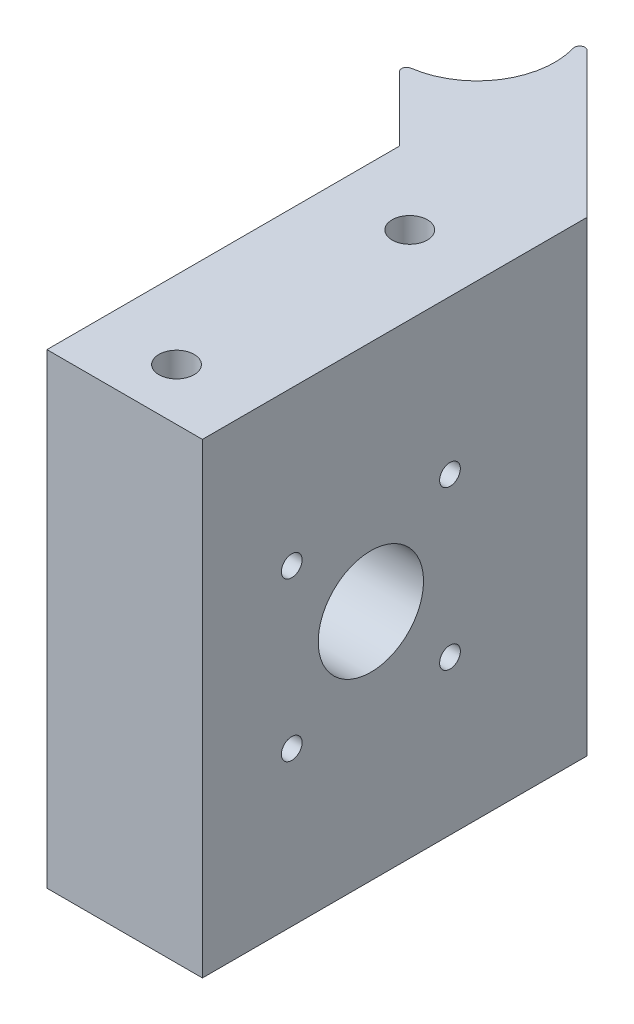
ISO-10303-21;
HEADER;
FILE_DESCRIPTION(('STEP AP214'),'2;1');
FILE_NAME('part.step','',(''),(''),'','','');
FILE_SCHEMA(('AUTOMOTIVE_DESIGN { 1 0 10303 214 1 1 1 1 }'));
ENDSEC;
DATA;
#1=APPLICATION_CONTEXT('core data for automotive mechanical design processes');
#2=APPLICATION_PROTOCOL_DEFINITION('international standard','automotive_design',2000,#1);
#3=PRODUCT_CONTEXT('',#1,'mechanical');
#4=PRODUCT('Part','Part','',(#3));
#5=PRODUCT_RELATED_PRODUCT_CATEGORY('part','',(#4));
#6=PRODUCT_DEFINITION_FORMATION('','',#4);
#7=PRODUCT_DEFINITION_CONTEXT('part definition',#1,'design');
#8=PRODUCT_DEFINITION('design','',#6,#7);
#9=PRODUCT_DEFINITION_SHAPE('','',#8);
#10=(LENGTH_UNIT() NAMED_UNIT(*) SI_UNIT(.MILLI.,.METRE.));
#11=(NAMED_UNIT(*) PLANE_ANGLE_UNIT() SI_UNIT($,.RADIAN.));
#12=(NAMED_UNIT(*) SI_UNIT($,.STERADIAN.) SOLID_ANGLE_UNIT());
#13=UNCERTAINTY_MEASURE_WITH_UNIT(LENGTH_MEASURE(1.E-05),#10,'distance_accuracy_value','');
#14=(GEOMETRIC_REPRESENTATION_CONTEXT(3) GLOBAL_UNCERTAINTY_ASSIGNED_CONTEXT((#13)) GLOBAL_UNIT_ASSIGNED_CONTEXT((#10,
#11,#12)) REPRESENTATION_CONTEXT('',''));
#15=CARTESIAN_POINT('',(0.,0.,0.));
#16=DIRECTION('',(0.,0.,1.));
#17=DIRECTION('',(1.,0.,0.));
#18=AXIS2_PLACEMENT_3D('',#15,#16,#17);
#19=CARTESIAN_POINT('',(10.7499999999999,45.,-10.7499999999998));
#20=DIRECTION('',(0.707106781186551,0.,-0.707106781186544));
#21=DIRECTION('',(-0.707106781186544,0.,-0.707106781186551));
#22=AXIS2_PLACEMENT_3D('',#19,#20,#21);
#23=PLANE('',#22);
#24=DIRECTION('',(0.707106781186541,0.,0.707106781186554));
#25=VECTOR('',#24,1.);
#26=CARTESIAN_POINT('',(-13.1082590496992,37.5,-34.6082590496992));
#27=LINE('',#26,#25);
#28=CARTESIAN_POINT('',(-13.1082590496992,37.5,-34.6082590496992));
#29=VERTEX_POINT('',#28);
#30=CARTESIAN_POINT('',(-11.8419971910119,37.5,-33.3419971910118));
#31=VERTEX_POINT('',#30);
#32=EDGE_CURVE('E278',#29,#31,#27,.T.);
#33=ORIENTED_EDGE('',*,*,#32,.F.);
#34=DIRECTION('',(0.,1.,0.));
#35=VECTOR('',#34,1.);
#36=CARTESIAN_POINT('',(-13.1082590496992,37.5,-34.6082590496992));
#37=LINE('',#36,#35);
#38=CARTESIAN_POINT('',(-13.1082590496992,41.5,-34.6082590496992));
#39=VERTEX_POINT('',#38);
#40=EDGE_CURVE('E293',#29,#39,#37,.T.);
#41=ORIENTED_EDGE('',*,*,#40,.T.);
#42=DIRECTION('',(0.707106781186541,0.,0.707106781186554));
#43=VECTOR('',#42,1.);
#44=CARTESIAN_POINT('',(-13.1082590496992,41.5,-34.6082590496992));
#45=LINE('',#44,#43);
#46=CARTESIAN_POINT('',(-11.8419971910119,41.5,-33.3419971910118));
#47=VERTEX_POINT('',#46);
#48=EDGE_CURVE('E296',#39,#47,#45,.T.);
#49=ORIENTED_EDGE('',*,*,#48,.T.);
#50=DIRECTION('',(0.,1.,0.));
#51=VECTOR('',#50,1.);
#52=CARTESIAN_POINT('',(-11.8419971910119,37.5,-33.3419971910118));
#53=LINE('',#52,#51);
#54=EDGE_CURVE('E321',#31,#47,#53,.T.);
#55=ORIENTED_EDGE('',*,*,#54,.F.);
#56=EDGE_LOOP('',(#33,#41,#49,#55));
#57=FACE_BOUND('',#56,.T.);
#58=DIRECTION('',(0.707106781186544,0.,0.707106781186551));
#59=VECTOR('',#58,1.);
#60=CARTESIAN_POINT('',(10.7499999999999,45.,-10.7499999999998));
#61=LINE('',#60,#59);
#62=CARTESIAN_POINT('',(-13.7262680860323,45.,-35.2262680860323));
#63=VERTEX_POINT('',#62);
#64=CARTESIAN_POINT('',(-7.5,45.,-28.9999999999999));
#65=VERTEX_POINT('',#64);
#66=EDGE_CURVE('E410',#63,#65,#61,.T.);
#67=ORIENTED_EDGE('',*,*,#66,.F.);
#68=DIRECTION('',(0.,1.,0.));
#69=VECTOR('',#68,1.);
#70=CARTESIAN_POINT('',(-13.7262680860323,0.,-35.2262680860323));
#71=LINE('',#70,#69);
#72=CARTESIAN_POINT('',(-13.7262680860323,0.,-35.2262680860323));
#73=VERTEX_POINT('',#72);
#74=EDGE_CURVE('E13',#63,#73,#71,.F.);
#75=ORIENTED_EDGE('',*,*,#74,.T.);
#76=DIRECTION('',(0.707106781186544,0.,0.707106781186551));
#77=VECTOR('',#76,1.);
#78=CARTESIAN_POINT('',(10.7499999999999,0.,-10.7499999999998));
#79=LINE('',#78,#77);
#80=CARTESIAN_POINT('',(-7.5,0.,-28.9999999999999));
#81=VERTEX_POINT('',#80);
#82=EDGE_CURVE('E433',#73,#81,#79,.T.);
#83=ORIENTED_EDGE('',*,*,#82,.T.);
#84=DIRECTION('',(0.,-1.,0.));
#85=VECTOR('',#84,1.);
#86=CARTESIAN_POINT('',(-7.5,45.,-28.9999999999999));
#87=LINE('',#86,#85);
#88=EDGE_CURVE('E457',#65,#81,#87,.T.);
#89=ORIENTED_EDGE('',*,*,#88,.F.);
#90=EDGE_LOOP('',(#67,#75,#83,#89));
#91=FACE_BOUND('',#90,.T.);
#92=DIRECTION('',(0.707106781186541,0.,0.707106781186554));
#93=VECTOR('',#92,1.);
#94=CARTESIAN_POINT('',(-13.1082590496992,20.5,-34.6082590496992));
#95=LINE('',#94,#93);
#96=CARTESIAN_POINT('',(-13.1082590496992,20.5,-34.6082590496992));
#97=VERTEX_POINT('',#96);
#98=CARTESIAN_POINT('',(-11.8419971910119,20.5,-33.3419971910118));
#99=VERTEX_POINT('',#98);
#100=EDGE_CURVE('E329',#97,#99,#95,.T.);
#101=ORIENTED_EDGE('',*,*,#100,.F.);
#102=DIRECTION('',(0.,1.,0.));
#103=VECTOR('',#102,1.);
#104=CARTESIAN_POINT('',(-13.1082590496992,20.5,-34.6082590496992));
#105=LINE('',#104,#103);
#106=CARTESIAN_POINT('',(-13.1082590496992,24.5,-34.6082590496992));
#107=VERTEX_POINT('',#106);
#108=EDGE_CURVE('E344',#97,#107,#105,.T.);
#109=ORIENTED_EDGE('',*,*,#108,.T.);
#110=DIRECTION('',(0.707106781186541,0.,0.707106781186554));
#111=VECTOR('',#110,1.);
#112=CARTESIAN_POINT('',(-13.1082590496992,24.5,-34.6082590496992));
#113=LINE('',#112,#111);
#114=CARTESIAN_POINT('',(-11.8419971910119,24.5,-33.3419971910118));
#115=VERTEX_POINT('',#114);
#116=EDGE_CURVE('E347',#107,#115,#113,.T.);
#117=ORIENTED_EDGE('',*,*,#116,.T.);
#118=DIRECTION('',(0.,1.,0.));
#119=VECTOR('',#118,1.);
#120=CARTESIAN_POINT('',(-11.8419971910119,20.5,-33.3419971910118));
#121=LINE('',#120,#119);
#122=EDGE_CURVE('E372',#99,#115,#121,.T.);
#123=ORIENTED_EDGE('',*,*,#122,.F.);
#124=EDGE_LOOP('',(#101,#109,#117,#123));
#125=FACE_BOUND('',#124,.T.);
#126=DIRECTION('',(0.707106781186541,0.,0.707106781186554));
#127=VECTOR('',#126,1.);
#128=CARTESIAN_POINT('',(-13.1082590496992,7.5,-34.6082590496992));
#129=LINE('',#128,#127);
#130=CARTESIAN_POINT('',(-13.1082590496992,7.5,-34.6082590496992));
#131=VERTEX_POINT('',#130);
#132=CARTESIAN_POINT('',(-11.8419971910119,7.5,-33.3419971910118));
#133=VERTEX_POINT('',#132);
#134=EDGE_CURVE('E240',#131,#133,#129,.T.);
#135=ORIENTED_EDGE('',*,*,#134,.T.);
#136=DIRECTION('',(0.,-1.,0.));
#137=VECTOR('',#136,1.);
#138=CARTESIAN_POINT('',(-11.8419971910119,7.5,-33.3419971910118));
#139=LINE('',#138,#137);
#140=CARTESIAN_POINT('',(-11.8419971910119,3.5,-33.3419971910118));
#141=VERTEX_POINT('',#140);
#142=EDGE_CURVE('E267',#133,#141,#139,.T.);
#143=ORIENTED_EDGE('',*,*,#142,.T.);
#144=DIRECTION('',(0.707106781186541,0.,0.707106781186554));
#145=VECTOR('',#144,1.);
#146=CARTESIAN_POINT('',(-13.1082590496992,3.5,-34.6082590496992));
#147=LINE('',#146,#145);
#148=CARTESIAN_POINT('',(-13.1082590496992,3.5,-34.6082590496992));
#149=VERTEX_POINT('',#148);
#150=EDGE_CURVE('E245',#149,#141,#147,.T.);
#151=ORIENTED_EDGE('',*,*,#150,.F.);
#152=DIRECTION('',(0.,-1.,0.));
#153=VECTOR('',#152,1.);
#154=CARTESIAN_POINT('',(-13.1082590496992,7.5,-34.6082590496992));
#155=LINE('',#154,#153);
#156=EDGE_CURVE('E264',#131,#149,#155,.T.);
#157=ORIENTED_EDGE('',*,*,#156,.F.);
#158=EDGE_LOOP('',(#135,#143,#151,#157));
#159=FACE_BOUND('',#158,.T.);
#160=ADVANCED_FACE('F48',(#57,#91,#125,#159),#23,.F.);
#161=CARTESIAN_POINT('',(19.8033008588991,45.,-19.8033008588988));
#162=DIRECTION('',(0.707106781186551,0.,-0.707106781186544));
#163=DIRECTION('',(-0.707106781186544,0.,-0.707106781186551));
#164=AXIS2_PLACEMENT_3D('',#161,#162,#163);
#165=PLANE('',#164);
#166=DIRECTION('',(0.707106781186544,0.,0.707106781186551));
#167=VECTOR('',#166,1.);
#168=CARTESIAN_POINT('',(19.8033008588991,0.,-19.8033008588988));
#169=LINE('',#168,#167);
#170=CARTESIAN_POINT('',(-6.45808635357504,0.,-46.0646880713732));
#171=VERTEX_POINT('',#170);
#172=CARTESIAN_POINT('',(7.49999999999999,0.,-32.106601717798));
#173=VERTEX_POINT('',#172);
#174=EDGE_CURVE('E444',#171,#173,#169,.T.);
#175=ORIENTED_EDGE('',*,*,#174,.F.);
#176=DIRECTION('',(0.,-1.,0.));
#177=VECTOR('',#176,1.);
#178=CARTESIAN_POINT('',(-6.45808635357505,45.,-46.0646880713732));
#179=LINE('',#178,#177);
#180=CARTESIAN_POINT('',(-6.45808635357504,45.,-46.0646880713732));
#181=VERTEX_POINT('',#180);
#182=EDGE_CURVE('E469',#171,#181,#179,.F.);
#183=ORIENTED_EDGE('',*,*,#182,.T.);
#184=DIRECTION('',(0.707106781186544,0.,0.707106781186551));
#185=VECTOR('',#184,1.);
#186=CARTESIAN_POINT('',(19.8033008588991,45.,-19.8033008588988));
#187=LINE('',#186,#185);
#188=CARTESIAN_POINT('',(7.49999999999999,45.,-32.106601717798));
#189=VERTEX_POINT('',#188);
#190=EDGE_CURVE('E422',#181,#189,#187,.T.);
#191=ORIENTED_EDGE('',*,*,#190,.T.);
#192=DIRECTION('',(0.,-1.,0.));
#193=VECTOR('',#192,1.);
#194=CARTESIAN_POINT('',(7.49999999999999,45.,-32.106601717798));
#195=LINE('',#194,#193);
#196=EDGE_CURVE('E430',#189,#173,#195,.T.);
#197=ORIENTED_EDGE('',*,*,#196,.T.);
#198=EDGE_LOOP('',(#175,#183,#191,#197));
#199=FACE_BOUND('',#198,.T.);
#200=DIRECTION('',(0.,1.,0.));
#201=VECTOR('',#200,1.);
#202=CARTESIAN_POINT('',(-2.83273811042198,20.5,-42.4393398282201));
#203=LINE('',#202,#201);
#204=CARTESIAN_POINT('',(-2.83273811042198,20.5,-42.4393398282201));
#205=VERTEX_POINT('',#204);
#206=CARTESIAN_POINT('',(-2.83273811042198,24.5,-42.4393398282201));
#207=VERTEX_POINT('',#206);
#208=EDGE_CURVE('E364',#205,#207,#203,.T.);
#209=ORIENTED_EDGE('',*,*,#208,.F.);
#210=DIRECTION('',(-0.707106781186544,0.,-0.707106781186551));
#211=VECTOR('',#210,1.);
#212=CARTESIAN_POINT('',(-2.83273811042198,20.5,-42.4393398282201));
#213=LINE('',#212,#211);
#214=CARTESIAN_POINT('',(-1.77207793864216,20.5,-41.3786796564403));
#215=VERTEX_POINT('',#214);
#216=EDGE_CURVE('E339',#215,#205,#213,.T.);
#217=ORIENTED_EDGE('',*,*,#216,.F.);
#218=DIRECTION('',(0.,1.,0.));
#219=VECTOR('',#218,1.);
#220=CARTESIAN_POINT('',(-1.77207793864216,20.5,-41.3786796564403));
#221=LINE('',#220,#219);
#222=CARTESIAN_POINT('',(-1.77207793864216,24.5,-41.3786796564403));
#223=VERTEX_POINT('',#222);
#224=EDGE_CURVE('E367',#215,#223,#221,.T.);
#225=ORIENTED_EDGE('',*,*,#224,.T.);
#226=DIRECTION('',(-0.707106781186544,0.,-0.707106781186551));
#227=VECTOR('',#226,1.);
#228=CARTESIAN_POINT('',(-2.83273811042198,24.5,-42.4393398282201));
#229=LINE('',#228,#227);
#230=EDGE_CURVE('E356',#223,#207,#229,.T.);
#231=ORIENTED_EDGE('',*,*,#230,.T.);
#232=EDGE_LOOP('',(#209,#217,#225,#231));
#233=FACE_BOUND('',#232,.T.);
#234=DIRECTION('',(0.,1.,0.));
#235=VECTOR('',#234,1.);
#236=CARTESIAN_POINT('',(-2.83273811042198,37.5,-42.4393398282201));
#237=LINE('',#236,#235);
#238=CARTESIAN_POINT('',(-2.83273811042198,37.5,-42.4393398282201));
#239=VERTEX_POINT('',#238);
#240=CARTESIAN_POINT('',(-2.83273811042198,41.5,-42.4393398282201));
#241=VERTEX_POINT('',#240);
#242=EDGE_CURVE('E313',#239,#241,#237,.T.);
#243=ORIENTED_EDGE('',*,*,#242,.F.);
#244=DIRECTION('',(-0.707106781186544,0.,-0.707106781186551));
#245=VECTOR('',#244,1.);
#246=CARTESIAN_POINT('',(-2.83273811042198,37.5,-42.4393398282201));
#247=LINE('',#246,#245);
#248=CARTESIAN_POINT('',(-1.77207793864216,37.5,-41.3786796564403));
#249=VERTEX_POINT('',#248);
#250=EDGE_CURVE('E288',#249,#239,#247,.T.);
#251=ORIENTED_EDGE('',*,*,#250,.F.);
#252=DIRECTION('',(0.,1.,0.));
#253=VECTOR('',#252,1.);
#254=CARTESIAN_POINT('',(-1.77207793864216,37.5,-41.3786796564403));
#255=LINE('',#254,#253);
#256=CARTESIAN_POINT('',(-1.77207793864216,41.5,-41.3786796564403));
#257=VERTEX_POINT('',#256);
#258=EDGE_CURVE('E316',#249,#257,#255,.T.);
#259=ORIENTED_EDGE('',*,*,#258,.T.);
#260=DIRECTION('',(-0.707106781186544,0.,-0.707106781186551));
#261=VECTOR('',#260,1.);
#262=CARTESIAN_POINT('',(-2.83273811042198,41.5,-42.4393398282201));
#263=LINE('',#262,#261);
#264=EDGE_CURVE('E305',#257,#241,#263,.T.);
#265=ORIENTED_EDGE('',*,*,#264,.T.);
#266=EDGE_LOOP('',(#243,#251,#259,#265));
#267=FACE_BOUND('',#266,.T.);
#268=DIRECTION('',(0.,-1.,0.));
#269=VECTOR('',#268,1.);
#270=CARTESIAN_POINT('',(-1.77207793864216,7.5,-41.3786796564403));
#271=LINE('',#270,#269);
#272=CARTESIAN_POINT('',(-1.77207793864216,7.5,-41.3786796564403));
#273=VERTEX_POINT('',#272);
#274=CARTESIAN_POINT('',(-1.77207793864216,3.5,-41.3786796564403));
#275=VERTEX_POINT('',#274);
#276=EDGE_CURVE('E71',#273,#275,#271,.T.);
#277=ORIENTED_EDGE('',*,*,#276,.F.);
#278=DIRECTION('',(-0.707106781186544,0.,-0.707106781186551));
#279=VECTOR('',#278,1.);
#280=CARTESIAN_POINT('',(-2.83273811042198,7.5,-42.4393398282201));
#281=LINE('',#280,#279);
#282=CARTESIAN_POINT('',(-2.83273811042198,7.5,-42.4393398282201));
#283=VERTEX_POINT('',#282);
#284=EDGE_CURVE('E233',#273,#283,#281,.T.);
#285=ORIENTED_EDGE('',*,*,#284,.T.);
#286=DIRECTION('',(0.,-1.,0.));
#287=VECTOR('',#286,1.);
#288=CARTESIAN_POINT('',(-2.83273811042198,7.5,-42.4393398282201));
#289=LINE('',#288,#287);
#290=CARTESIAN_POINT('',(-2.83273811042198,3.5,-42.4393398282201));
#291=VERTEX_POINT('',#290);
#292=EDGE_CURVE('E228',#283,#291,#289,.T.);
#293=ORIENTED_EDGE('',*,*,#292,.T.);
#294=DIRECTION('',(-0.707106781186544,0.,-0.707106781186551));
#295=VECTOR('',#294,1.);
#296=CARTESIAN_POINT('',(-2.83273811042198,3.5,-42.4393398282201));
#297=LINE('',#296,#295);
#298=EDGE_CURVE('E259',#275,#291,#297,.T.);
#299=ORIENTED_EDGE('',*,*,#298,.F.);
#300=EDGE_LOOP('',(#277,#285,#293,#299));
#301=FACE_BOUND('',#300,.T.);
#302=ADVANCED_FACE('F493',(#199,#233,#267,#301),#165,.T.);
#303=CARTESIAN_POINT('',(-14.5,45.,-43.5));
#304=DIRECTION('',(0.,-1.,0.));
#305=DIRECTION('',(0.,0.,-1.));
#306=AXIS2_PLACEMENT_3D('',#303,#304,#305);
#307=CYLINDRICAL_SURFACE('',#306,7.5);
#308=CARTESIAN_POINT('',(-14.5,45.,-43.5));
#309=DIRECTION('',(0.,1.,0.));
#310=DIRECTION('',(0.,0.,1.));
#311=AXIS2_PLACEMENT_3D('',#308,#309,#310);
#312=CIRCLE('',#311,7.5);
#313=CARTESIAN_POINT('',(-13.4431700269741,45.,-36.0748326343365));
#314=VERTEX_POINT('',#313);
#315=CARTESIAN_POINT('',(-7.2921622601578,45.,-45.5729387632312));
#316=VERTEX_POINT('',#315);
#317=EDGE_CURVE('E407',#314,#316,#312,.T.);
#318=ORIENTED_EDGE('',*,*,#317,.T.);
#319=DIRECTION('',(0.,-1.,0.));
#320=VECTOR('',#319,1.);
#321=CARTESIAN_POINT('',(-7.2921622601578,45.,-45.5729387632312));
#322=LINE('',#321,#320);
#323=CARTESIAN_POINT('',(-7.2921622601578,0.,-45.5729387632312));
#324=VERTEX_POINT('',#323);
#325=EDGE_CURVE('E462',#316,#324,#322,.T.);
#326=ORIENTED_EDGE('',*,*,#325,.T.);
#327=CARTESIAN_POINT('',(-14.5,0.,-43.5));
#328=DIRECTION('',(0.,1.,0.));
#329=DIRECTION('',(0.,0.,1.));
#330=AXIS2_PLACEMENT_3D('',#327,#328,#329);
#331=CIRCLE('',#330,7.5);
#332=CARTESIAN_POINT('',(-13.4431700269741,0.,-36.0748326343365));
#333=VERTEX_POINT('',#332);
#334=EDGE_CURVE('E404',#333,#324,#331,.T.);
#335=ORIENTED_EDGE('',*,*,#334,.F.);
#336=DIRECTION('',(0.,-1.,0.));
#337=VECTOR('',#336,1.);
#338=CARTESIAN_POINT('',(-13.4431700269741,45.,-36.0748326343365));
#339=LINE('',#338,#337);
#340=EDGE_CURVE('E460',#333,#314,#339,.F.);
#341=ORIENTED_EDGE('',*,*,#340,.T.);
#342=EDGE_LOOP('',(#318,#326,#335,#341));
#343=FACE_BOUND('',#342,.T.);
#344=ADVANCED_FACE('F484',(#343),#307,.F.);
#345=CARTESIAN_POINT('',(-7.5,45.,0.));
#346=DIRECTION('',(-1.,0.,0.));
#347=DIRECTION('',(0.,0.,1.));
#348=AXIS2_PLACEMENT_3D('',#345,#346,#347);
#349=PLANE('',#348);
#350=CARTESIAN_POINT('',(-7.5,14.867,-3.617));
#351=DIRECTION('',(-1.,0.,0.));
#352=DIRECTION('',(0.,0.,1.));
#353=AXIS2_PLACEMENT_3D('',#350,#351,#352);
#354=CIRCLE('',#353,1.);
#355=CARTESIAN_POINT('',(-7.5,14.867,-2.617));
#356=VERTEX_POINT('',#355);
#357=EDGE_CURVE('E363',#356,#356,#354,.F.);
#358=ORIENTED_EDGE('',*,*,#357,.T.);
#359=EDGE_LOOP('',(#358));
#360=FACE_BOUND('',#359,.T.);
#361=CARTESIAN_POINT('',(-7.5,14.867,-18.883));
#362=DIRECTION('',(-1.,0.,0.));
#363=DIRECTION('',(0.,0.,1.));
#364=AXIS2_PLACEMENT_3D('',#361,#362,#363);
#365=CIRCLE('',#364,1.);
#366=CARTESIAN_POINT('',(-7.5,14.867,-17.883));
#367=VERTEX_POINT('',#366);
#368=EDGE_CURVE('E380',#367,#367,#365,.F.);
#369=ORIENTED_EDGE('',*,*,#368,.T.);
#370=EDGE_LOOP('',(#369));
#371=FACE_BOUND('',#370,.T.);
#372=CARTESIAN_POINT('',(-7.5,30.133,-18.883));
#373=DIRECTION('',(-1.,0.,0.));
#374=DIRECTION('',(0.,0.,1.));
#375=AXIS2_PLACEMENT_3D('',#372,#373,#374);
#376=CIRCLE('',#375,1.);
#377=CARTESIAN_POINT('',(-7.5,30.133,-17.883));
#378=VERTEX_POINT('',#377);
#379=EDGE_CURVE('E386',#378,#378,#376,.F.);
#380=ORIENTED_EDGE('',*,*,#379,.T.);
#381=EDGE_LOOP('',(#380));
#382=FACE_BOUND('',#381,.T.);
#383=CARTESIAN_POINT('',(-7.5,30.133,-3.617));
#384=DIRECTION('',(-1.,0.,0.));
#385=DIRECTION('',(0.,0.,1.));
#386=AXIS2_PLACEMENT_3D('',#383,#384,#385);
#387=CIRCLE('',#386,1.);
#388=CARTESIAN_POINT('',(-7.5,30.133,-2.617));
#389=VERTEX_POINT('',#388);
#390=EDGE_CURVE('E392',#389,#389,#387,.F.);
#391=ORIENTED_EDGE('',*,*,#390,.T.);
#392=EDGE_LOOP('',(#391));
#393=FACE_BOUND('',#392,.T.);
#394=CARTESIAN_POINT('',(-7.5,22.5,-11.25));
#395=DIRECTION('',(-1.,0.,0.));
#396=DIRECTION('',(0.,0.,1.));
#397=AXIS2_PLACEMENT_3D('',#394,#395,#396);
#398=CIRCLE('',#397,5.08);
#399=CARTESIAN_POINT('',(-7.5,22.5,-6.17));
#400=VERTEX_POINT('',#399);
#401=EDGE_CURVE('E398',#400,#400,#398,.F.);
#402=ORIENTED_EDGE('',*,*,#401,.T.);
#403=EDGE_LOOP('',(#402));
#404=FACE_BOUND('',#403,.T.);
#405=DIRECTION('',(0.,0.,-1.));
#406=VECTOR('',#405,1.);
#407=CARTESIAN_POINT('',(-7.5,0.,0.));
#408=LINE('',#407,#406);
#409=CARTESIAN_POINT('',(-7.5,0.,5.));
#410=VERTEX_POINT('',#409);
#411=EDGE_CURVE('E435',#410,#81,#408,.T.);
#412=ORIENTED_EDGE('',*,*,#411,.F.);
#413=DIRECTION('',(0.,-1.,0.));
#414=VECTOR('',#413,1.);
#415=CARTESIAN_POINT('',(-7.5,45.,5.));
#416=LINE('',#415,#414);
#417=CARTESIAN_POINT('',(-7.5,45.,5.));
#418=VERTEX_POINT('',#417);
#419=EDGE_CURVE('E455',#418,#410,#416,.T.);
#420=ORIENTED_EDGE('',*,*,#419,.F.);
#421=DIRECTION('',(0.,0.,-1.));
#422=VECTOR('',#421,1.);
#423=CARTESIAN_POINT('',(-7.5,45.,0.));
#424=LINE('',#423,#422);
#425=EDGE_CURVE('E413',#418,#65,#424,.T.);
#426=ORIENTED_EDGE('',*,*,#425,.T.);
#427=ORIENTED_EDGE('',*,*,#88,.T.);
#428=EDGE_LOOP('',(#412,#420,#426,#427));
#429=FACE_BOUND('',#428,.T.);
#430=ADVANCED_FACE('F507',(#360,#371,#382,#393,#404,#429),#349,.T.);
#431=CARTESIAN_POINT('',(0.,45.,5.));
#432=DIRECTION('',(0.,0.,1.));
#433=DIRECTION('',(1.,0.,0.));
#434=AXIS2_PLACEMENT_3D('',#431,#432,#433);
#435=PLANE('',#434);
#436=DIRECTION('',(-1.,0.,0.));
#437=VECTOR('',#436,1.);
#438=CARTESIAN_POINT('',(0.,0.,5.));
#439=LINE('',#438,#437);
#440=CARTESIAN_POINT('',(7.5,0.,5.));
#441=VERTEX_POINT('',#440);
#442=EDGE_CURVE('E438',#441,#410,#439,.T.);
#443=ORIENTED_EDGE('',*,*,#442,.F.);
#444=DIRECTION('',(0.,-1.,0.));
#445=VECTOR('',#444,1.);
#446=CARTESIAN_POINT('',(7.5,45.,5.));
#447=LINE('',#446,#445);
#448=CARTESIAN_POINT('',(7.5,45.,5.));
#449=VERTEX_POINT('',#448);
#450=EDGE_CURVE('E453',#449,#441,#447,.T.);
#451=ORIENTED_EDGE('',*,*,#450,.F.);
#452=DIRECTION('',(-1.,0.,0.));
#453=VECTOR('',#452,1.);
#454=CARTESIAN_POINT('',(0.,45.,5.));
#455=LINE('',#454,#453);
#456=EDGE_CURVE('E416',#449,#418,#455,.T.);
#457=ORIENTED_EDGE('',*,*,#456,.T.);
#458=ORIENTED_EDGE('',*,*,#419,.T.);
#459=EDGE_LOOP('',(#443,#451,#457,#458));
#460=FACE_BOUND('',#459,.T.);
#461=ADVANCED_FACE('F503',(#460),#435,.T.);
#462=CARTESIAN_POINT('',(7.5,45.,0.));
#463=DIRECTION('',(1.,0.,0.));
#464=DIRECTION('',(0.,0.,-1.));
#465=AXIS2_PLACEMENT_3D('',#462,#463,#464);
#466=PLANE('',#465);
#467=CARTESIAN_POINT('',(7.5,14.867,-3.617));
#468=DIRECTION('',(1.,0.,0.));
#469=DIRECTION('',(0.,0.,-1.));
#470=AXIS2_PLACEMENT_3D('',#467,#468,#469);
#471=CIRCLE('',#470,1.);
#472=CARTESIAN_POINT('',(7.5,14.867,-4.617));
#473=VERTEX_POINT('',#472);
#474=EDGE_CURVE('E377',#473,#473,#471,.T.);
#475=ORIENTED_EDGE('',*,*,#474,.F.);
#476=EDGE_LOOP('',(#475));
#477=FACE_BOUND('',#476,.T.);
#478=CARTESIAN_POINT('',(7.5,14.867,-18.883));
#479=DIRECTION('',(1.,0.,0.));
#480=DIRECTION('',(0.,0.,-1.));
#481=AXIS2_PLACEMENT_3D('',#478,#479,#480);
#482=CIRCLE('',#481,1.);
#483=CARTESIAN_POINT('',(7.5,14.867,-19.883));
#484=VERTEX_POINT('',#483);
#485=EDGE_CURVE('E383',#484,#484,#482,.T.);
#486=ORIENTED_EDGE('',*,*,#485,.F.);
#487=EDGE_LOOP('',(#486));
#488=FACE_BOUND('',#487,.T.);
#489=CARTESIAN_POINT('',(7.5,30.133,-18.883));
#490=DIRECTION('',(1.,0.,0.));
#491=DIRECTION('',(0.,0.,-1.));
#492=AXIS2_PLACEMENT_3D('',#489,#490,#491);
#493=CIRCLE('',#492,1.);
#494=CARTESIAN_POINT('',(7.5,30.133,-19.883));
#495=VERTEX_POINT('',#494);
#496=EDGE_CURVE('E389',#495,#495,#493,.T.);
#497=ORIENTED_EDGE('',*,*,#496,.F.);
#498=EDGE_LOOP('',(#497));
#499=FACE_BOUND('',#498,.T.);
#500=CARTESIAN_POINT('',(7.5,30.133,-3.617));
#501=DIRECTION('',(1.,0.,0.));
#502=DIRECTION('',(0.,0.,-1.));
#503=AXIS2_PLACEMENT_3D('',#500,#501,#502);
#504=CIRCLE('',#503,1.);
#505=CARTESIAN_POINT('',(7.5,30.133,-4.617));
#506=VERTEX_POINT('',#505);
#507=EDGE_CURVE('E395',#506,#506,#504,.T.);
#508=ORIENTED_EDGE('',*,*,#507,.F.);
#509=EDGE_LOOP('',(#508));
#510=FACE_BOUND('',#509,.T.);
#511=CARTESIAN_POINT('',(7.5,22.5,-11.25));
#512=DIRECTION('',(1.,0.,0.));
#513=DIRECTION('',(0.,0.,-1.));
#514=AXIS2_PLACEMENT_3D('',#511,#512,#513);
#515=CIRCLE('',#514,5.08);
#516=CARTESIAN_POINT('',(7.5,22.5,-16.33));
#517=VERTEX_POINT('',#516);
#518=EDGE_CURVE('E401',#517,#517,#515,.T.);
#519=ORIENTED_EDGE('',*,*,#518,.F.);
#520=EDGE_LOOP('',(#519));
#521=FACE_BOUND('',#520,.T.);
#522=DIRECTION('',(0.,0.,1.));
#523=VECTOR('',#522,1.);
#524=CARTESIAN_POINT('',(7.5,0.,0.));
#525=LINE('',#524,#523);
#526=EDGE_CURVE('E441',#173,#441,#525,.T.);
#527=ORIENTED_EDGE('',*,*,#526,.F.);
#528=ORIENTED_EDGE('',*,*,#196,.F.);
#529=DIRECTION('',(0.,0.,1.));
#530=VECTOR('',#529,1.);
#531=CARTESIAN_POINT('',(7.5,45.,0.));
#532=LINE('',#531,#530);
#533=EDGE_CURVE('E419',#189,#449,#532,.T.);
#534=ORIENTED_EDGE('',*,*,#533,.T.);
#535=ORIENTED_EDGE('',*,*,#450,.T.);
#536=EDGE_LOOP('',(#527,#528,#534,#535));
#537=FACE_BOUND('',#536,.T.);
#538=ADVANCED_FACE('F498',(#477,#488,#499,#510,#521,#537),#466,.T.);
#539=CARTESIAN_POINT('',(0.,45.,0.));
#540=DIRECTION('',(0.,-1.,0.));
#541=DIRECTION('',(0.,0.,-1.));
#542=AXIS2_PLACEMENT_3D('',#539,#540,#541);
#543=CYLINDRICAL_SURFACE('',#542,1.7);
#544=CARTESIAN_POINT('',(0.,45.,0.));
#545=DIRECTION('',(0.,1.,0.));
#546=DIRECTION('',(0.,0.,1.));
#547=AXIS2_PLACEMENT_3D('',#544,#545,#546);
#548=CIRCLE('',#547,1.7);
#549=CARTESIAN_POINT('',(0.,45.,1.7));
#550=VERTEX_POINT('',#549);
#551=EDGE_CURVE('E424',#550,#550,#548,.T.);
#552=ORIENTED_EDGE('',*,*,#551,.T.);
#553=EDGE_LOOP('',(#552));
#554=FACE_BOUND('',#553,.T.);
#555=CARTESIAN_POINT('',(0.,0.,0.));
#556=DIRECTION('',(0.,1.,0.));
#557=DIRECTION('',(0.,0.,1.));
#558=AXIS2_PLACEMENT_3D('',#555,#556,#557);
#559=CIRCLE('',#558,1.7);
#560=CARTESIAN_POINT('',(0.,0.,1.7));
#561=VERTEX_POINT('',#560);
#562=EDGE_CURVE('E446',#561,#561,#559,.T.);
#563=ORIENTED_EDGE('',*,*,#562,.F.);
#564=EDGE_LOOP('',(#563));
#565=FACE_BOUND('',#564,.T.);
#566=ADVANCED_FACE('F561',(#554,#565),#543,.F.);
#567=CARTESIAN_POINT('',(0.,45.,-22.5));
#568=DIRECTION('',(0.,-1.,0.));
#569=DIRECTION('',(0.,0.,-1.));
#570=AXIS2_PLACEMENT_3D('',#567,#568,#569);
#571=CYLINDRICAL_SURFACE('',#570,1.7);
#572=CARTESIAN_POINT('',(0.,45.,-22.5));
#573=DIRECTION('',(0.,1.,0.));
#574=DIRECTION('',(0.,0.,1.));
#575=AXIS2_PLACEMENT_3D('',#572,#573,#574);
#576=CIRCLE('',#575,1.7);
#577=CARTESIAN_POINT('',(0.,45.,-20.8));
#578=VERTEX_POINT('',#577);
#579=EDGE_CURVE('E427',#578,#578,#576,.T.);
#580=ORIENTED_EDGE('',*,*,#579,.T.);
#581=EDGE_LOOP('',(#580));
#582=FACE_BOUND('',#581,.T.);
#583=CARTESIAN_POINT('',(0.,0.,-22.5));
#584=DIRECTION('',(0.,1.,0.));
#585=DIRECTION('',(0.,0.,1.));
#586=AXIS2_PLACEMENT_3D('',#583,#584,#585);
#587=CIRCLE('',#586,1.7);
#588=CARTESIAN_POINT('',(0.,0.,-20.8));
#589=VERTEX_POINT('',#588);
#590=EDGE_CURVE('E411',#589,#589,#587,.T.);
#591=ORIENTED_EDGE('',*,*,#590,.F.);
#592=EDGE_LOOP('',(#591));
#593=FACE_BOUND('',#592,.T.);
#594=ADVANCED_FACE('F567',(#582,#593),#571,.F.);
#595=CARTESIAN_POINT('',(0.,45.,0.));
#596=DIRECTION('',(0.,1.,0.));
#597=DIRECTION('',(0.,0.,1.));
#598=AXIS2_PLACEMENT_3D('',#595,#596,#597);
#599=PLANE('',#598);
#600=ORIENTED_EDGE('',*,*,#190,.F.);
#601=CARTESIAN_POINT('',(-6.81163974416832,45.,-45.7111346807799));
#602=DIRECTION('',(0.,1.,0.));
#603=DIRECTION('',(0.,0.,1.));
#604=AXIS2_PLACEMENT_3D('',#601,#602,#603);
#605=CIRCLE('',#604,0.5);
#606=EDGE_CURVE('E56',#181,#316,#605,.T.);
#607=ORIENTED_EDGE('',*,*,#606,.T.);
#608=ORIENTED_EDGE('',*,*,#317,.F.);
#609=CARTESIAN_POINT('',(-13.3727146954391,45.,-35.5798214766256));
#610=DIRECTION('',(0.,1.,0.));
#611=DIRECTION('',(0.,0.,1.));
#612=AXIS2_PLACEMENT_3D('',#609,#610,#611);
#613=CIRCLE('',#612,0.5);
#614=EDGE_CURVE('E471',#314,#63,#613,.T.);
#615=ORIENTED_EDGE('',*,*,#614,.T.);
#616=ORIENTED_EDGE('',*,*,#66,.T.);
#617=ORIENTED_EDGE('',*,*,#425,.F.);
#618=ORIENTED_EDGE('',*,*,#456,.F.);
#619=ORIENTED_EDGE('',*,*,#533,.F.);
#620=EDGE_LOOP('',(#600,#607,#608,#615,#616,#617,#618,#619));
#621=FACE_BOUND('',#620,.T.);
#622=ORIENTED_EDGE('',*,*,#551,.F.);
#623=EDGE_LOOP('',(#622));
#624=FACE_BOUND('',#623,.T.);
#625=ORIENTED_EDGE('',*,*,#579,.F.);
#626=EDGE_LOOP('',(#625));
#627=FACE_BOUND('',#626,.T.);
#628=ADVANCED_FACE('F476',(#621,#624,#627),#599,.T.);
#629=CARTESIAN_POINT('',(0.,0.,0.));
#630=DIRECTION('',(0.,1.,0.));
#631=DIRECTION('',(0.,0.,1.));
#632=AXIS2_PLACEMENT_3D('',#629,#630,#631);
#633=PLANE('',#632);
#634=ORIENTED_EDGE('',*,*,#334,.T.);
#635=CARTESIAN_POINT('',(-6.81163974416832,0.,-45.7111346807799));
#636=DIRECTION('',(0.,1.,0.));
#637=DIRECTION('',(0.,0.,1.));
#638=AXIS2_PLACEMENT_3D('',#635,#636,#637);
#639=CIRCLE('',#638,0.5);
#640=EDGE_CURVE('E467',#324,#171,#639,.F.);
#641=ORIENTED_EDGE('',*,*,#640,.T.);
#642=ORIENTED_EDGE('',*,*,#174,.T.);
#643=ORIENTED_EDGE('',*,*,#526,.T.);
#644=ORIENTED_EDGE('',*,*,#442,.T.);
#645=ORIENTED_EDGE('',*,*,#411,.T.);
#646=ORIENTED_EDGE('',*,*,#82,.F.);
#647=CARTESIAN_POINT('',(-13.3727146954391,0.,-35.5798214766256));
#648=DIRECTION('',(0.,1.,0.));
#649=DIRECTION('',(0.,0.,1.));
#650=AXIS2_PLACEMENT_3D('',#647,#648,#649);
#651=CIRCLE('',#650,0.5);
#652=EDGE_CURVE('E465',#73,#333,#651,.F.);
#653=ORIENTED_EDGE('',*,*,#652,.T.);
#654=EDGE_LOOP('',(#634,#641,#642,#643,#644,#645,#646,#653));
#655=FACE_BOUND('',#654,.T.);
#656=ORIENTED_EDGE('',*,*,#562,.T.);
#657=EDGE_LOOP('',(#656));
#658=FACE_BOUND('',#657,.T.);
#659=ORIENTED_EDGE('',*,*,#590,.T.);
#660=EDGE_LOOP('',(#659));
#661=FACE_BOUND('',#660,.T.);
#662=ADVANCED_FACE('F490',(#655,#658,#661),#633,.F.);
#663=CARTESIAN_POINT('',(-14.501,22.5,-11.25));
#664=DIRECTION('',(1.,0.,0.));
#665=DIRECTION('',(0.,0.,-1.));
#666=AXIS2_PLACEMENT_3D('',#663,#664,#665);
#667=CYLINDRICAL_SURFACE('',#666,5.08);
#668=ORIENTED_EDGE('',*,*,#401,.F.);
#669=EDGE_LOOP('',(#668));
#670=FACE_BOUND('',#669,.T.);
#671=ORIENTED_EDGE('',*,*,#518,.T.);
#672=EDGE_LOOP('',(#671));
#673=FACE_BOUND('',#672,.T.);
#674=ADVANCED_FACE('F553',(#670,#673),#667,.F.);
#675=CARTESIAN_POINT('',(-14.501,30.133,-3.617));
#676=DIRECTION('',(1.,0.,0.));
#677=DIRECTION('',(0.,0.,-1.));
#678=AXIS2_PLACEMENT_3D('',#675,#676,#677);
#679=CYLINDRICAL_SURFACE('',#678,1.);
#680=ORIENTED_EDGE('',*,*,#390,.F.);
#681=EDGE_LOOP('',(#680));
#682=FACE_BOUND('',#681,.T.);
#683=ORIENTED_EDGE('',*,*,#507,.T.);
#684=EDGE_LOOP('',(#683));
#685=FACE_BOUND('',#684,.T.);
#686=ADVANCED_FACE('F556',(#682,#685),#679,.F.);
#687=CARTESIAN_POINT('',(-14.501,30.133,-18.883));
#688=DIRECTION('',(1.,0.,0.));
#689=DIRECTION('',(0.,0.,-1.));
#690=AXIS2_PLACEMENT_3D('',#687,#688,#689);
#691=CYLINDRICAL_SURFACE('',#690,1.);
#692=ORIENTED_EDGE('',*,*,#379,.F.);
#693=EDGE_LOOP('',(#692));
#694=FACE_BOUND('',#693,.T.);
#695=ORIENTED_EDGE('',*,*,#496,.T.);
#696=EDGE_LOOP('',(#695));
#697=FACE_BOUND('',#696,.T.);
#698=ADVANCED_FACE('F582',(#694,#697),#691,.F.);
#699=CARTESIAN_POINT('',(-14.501,14.867,-18.883));
#700=DIRECTION('',(1.,0.,0.));
#701=DIRECTION('',(0.,0.,-1.));
#702=AXIS2_PLACEMENT_3D('',#699,#700,#701);
#703=CYLINDRICAL_SURFACE('',#702,1.);
#704=ORIENTED_EDGE('',*,*,#368,.F.);
#705=EDGE_LOOP('',(#704));
#706=FACE_BOUND('',#705,.T.);
#707=ORIENTED_EDGE('',*,*,#485,.T.);
#708=EDGE_LOOP('',(#707));
#709=FACE_BOUND('',#708,.T.);
#710=ADVANCED_FACE('F586',(#706,#709),#703,.F.);
#711=CARTESIAN_POINT('',(-14.501,14.867,-3.617));
#712=DIRECTION('',(1.,0.,0.));
#713=DIRECTION('',(0.,0.,-1.));
#714=AXIS2_PLACEMENT_3D('',#711,#712,#713);
#715=CYLINDRICAL_SURFACE('',#714,1.);
#716=ORIENTED_EDGE('',*,*,#357,.F.);
#717=EDGE_LOOP('',(#716));
#718=FACE_BOUND('',#717,.T.);
#719=ORIENTED_EDGE('',*,*,#474,.T.);
#720=EDGE_LOOP('',(#719));
#721=FACE_BOUND('',#720,.T.);
#722=ADVANCED_FACE('F523',(#718,#721),#715,.F.);
#723=CARTESIAN_POINT('',(-6.81163974416832,45.,-45.7111346807799));
#724=DIRECTION('',(0.,-1.,0.));
#725=DIRECTION('',(0.,0.,-1.));
#726=AXIS2_PLACEMENT_3D('',#723,#724,#725);
#727=CYLINDRICAL_SURFACE('',#726,0.5);
#728=ORIENTED_EDGE('',*,*,#606,.F.);
#729=ORIENTED_EDGE('',*,*,#182,.F.);
#730=ORIENTED_EDGE('',*,*,#640,.F.);
#731=ORIENTED_EDGE('',*,*,#325,.F.);
#732=EDGE_LOOP('',(#728,#729,#730,#731));
#733=FACE_BOUND('',#732,.T.);
#734=ADVANCED_FACE('F487',(#733),#727,.T.);
#735=CARTESIAN_POINT('',(-13.3727146954391,45.,-35.5798214766256));
#736=DIRECTION('',(0.,-1.,0.));
#737=DIRECTION('',(0.,0.,-1.));
#738=AXIS2_PLACEMENT_3D('',#735,#736,#737);
#739=CYLINDRICAL_SURFACE('',#738,0.5);
#740=ORIENTED_EDGE('',*,*,#614,.F.);
#741=ORIENTED_EDGE('',*,*,#340,.F.);
#742=ORIENTED_EDGE('',*,*,#652,.F.);
#743=ORIENTED_EDGE('',*,*,#74,.F.);
#744=EDGE_LOOP('',(#740,#741,#742,#743));
#745=FACE_BOUND('',#744,.T.);
#746=ADVANCED_FACE('F50',(#745),#739,.T.);
#747=CARTESIAN_POINT('',(-14.5,20.5,-43.5));
#748=DIRECTION('',(0.,1.,0.));
#749=DIRECTION('',(0.,0.,1.));
#750=AXIS2_PLACEMENT_3D('',#747,#748,#749);
#751=CYLINDRICAL_SURFACE('',#750,9.);
#752=CARTESIAN_POINT('',(-14.5,24.5,-43.5));
#753=DIRECTION('',(0.,-1.,0.));
#754=DIRECTION('',(0.,0.,1.));
#755=AXIS2_PLACEMENT_3D('',#752,#753,#754);
#756=CIRCLE('',#755,9.);
#757=CARTESIAN_POINT('',(-8.1360389693211,24.5,-37.136038969321));
#758=VERTEX_POINT('',#757);
#759=EDGE_CURVE('E312',#758,#107,#756,.T.);
#760=ORIENTED_EDGE('',*,*,#759,.T.);
#761=ORIENTED_EDGE('',*,*,#108,.F.);
#762=CARTESIAN_POINT('',(-14.5,20.5,-43.5));
#763=DIRECTION('',(0.,-1.,0.));
#764=DIRECTION('',(0.,0.,1.));
#765=AXIS2_PLACEMENT_3D('',#762,#763,#764);
#766=CIRCLE('',#765,9.);
#767=CARTESIAN_POINT('',(-8.1360389693211,20.5,-37.136038969321));
#768=VERTEX_POINT('',#767);
#769=EDGE_CURVE('E326',#768,#97,#766,.T.);
#770=ORIENTED_EDGE('',*,*,#769,.F.);
#771=DIRECTION('',(0.,1.,0.));
#772=VECTOR('',#771,1.);
#773=CARTESIAN_POINT('',(-8.1360389693211,20.5,-37.136038969321));
#774=LINE('',#773,#772);
#775=EDGE_CURVE('E361',#768,#758,#774,.T.);
#776=ORIENTED_EDGE('',*,*,#775,.T.);
#777=EDGE_LOOP('',(#760,#761,#770,#776));
#778=FACE_BOUND('',#777,.T.);
#779=ADVANCED_FACE('F515',(#778),#751,.T.);
#780=CARTESIAN_POINT('',(-8.1360389693211,20.5,-37.136038969321));
#781=DIRECTION('',(-0.707106781186544,0.,-0.707106781186551));
#782=DIRECTION('',(-0.707106781186551,0.,0.707106781186544));
#783=AXIS2_PLACEMENT_3D('',#780,#781,#782);
#784=PLANE('',#783);
#785=DIRECTION('',(-0.707106781186551,0.,0.707106781186544));
#786=VECTOR('',#785,1.);
#787=CARTESIAN_POINT('',(-8.1360389693211,24.5,-37.136038969321));
#788=LINE('',#787,#786);
#789=EDGE_CURVE('E330',#207,#758,#788,.T.);
#790=ORIENTED_EDGE('',*,*,#789,.T.);
#791=ORIENTED_EDGE('',*,*,#775,.F.);
#792=DIRECTION('',(-0.707106781186551,0.,0.707106781186544));
#793=VECTOR('',#792,1.);
#794=CARTESIAN_POINT('',(-8.1360389693211,20.5,-37.136038969321));
#795=LINE('',#794,#793);
#796=EDGE_CURVE('E341',#205,#768,#795,.T.);
#797=ORIENTED_EDGE('',*,*,#796,.F.);
#798=ORIENTED_EDGE('',*,*,#208,.T.);
#799=EDGE_LOOP('',(#790,#791,#797,#798));
#800=FACE_BOUND('',#799,.T.);
#801=ADVANCED_FACE('F520',(#800),#784,.F.);
#802=CARTESIAN_POINT('',(-1.77207793864216,20.5,-41.3786796564403));
#803=DIRECTION('',(0.707106781186544,0.,0.707106781186551));
#804=DIRECTION('',(0.707106781186551,0.,-0.707106781186544));
#805=AXIS2_PLACEMENT_3D('',#802,#803,#804);
#806=PLANE('',#805);
#807=DIRECTION('',(0.707106781186551,0.,-0.707106781186544));
#808=VECTOR('',#807,1.);
#809=CARTESIAN_POINT('',(-1.77207793864216,24.5,-41.3786796564403));
#810=LINE('',#809,#808);
#811=CARTESIAN_POINT('',(-7.07537879754129,24.5,-36.0753787975412));
#812=VERTEX_POINT('',#811);
#813=EDGE_CURVE('E353',#812,#223,#810,.T.);
#814=ORIENTED_EDGE('',*,*,#813,.T.);
#815=ORIENTED_EDGE('',*,*,#224,.F.);
#816=DIRECTION('',(0.707106781186551,0.,-0.707106781186544));
#817=VECTOR('',#816,1.);
#818=CARTESIAN_POINT('',(-1.77207793864216,20.5,-41.3786796564403));
#819=LINE('',#818,#817);
#820=CARTESIAN_POINT('',(-7.07537879754129,20.5,-36.0753787975412));
#821=VERTEX_POINT('',#820);
#822=EDGE_CURVE('E336',#821,#215,#819,.T.);
#823=ORIENTED_EDGE('',*,*,#822,.F.);
#824=DIRECTION('',(0.,1.,0.));
#825=VECTOR('',#824,1.);
#826=CARTESIAN_POINT('',(-7.07537879754129,20.5,-36.0753787975412));
#827=LINE('',#826,#825);
#828=EDGE_CURVE('E370',#821,#812,#827,.T.);
#829=ORIENTED_EDGE('',*,*,#828,.T.);
#830=EDGE_LOOP('',(#814,#815,#823,#829));
#831=FACE_BOUND('',#830,.T.);
#832=ADVANCED_FACE('F598',(#831),#806,.F.);
#833=CARTESIAN_POINT('',(-14.5,20.5,-43.5));
#834=DIRECTION('',(0.,1.,0.));
#835=DIRECTION('',(0.,0.,1.));
#836=AXIS2_PLACEMENT_3D('',#833,#834,#835);
#837=CYLINDRICAL_SURFACE('',#836,10.5);
#838=CARTESIAN_POINT('',(-14.5,24.5,-43.5));
#839=DIRECTION('',(0.,1.,0.));
#840=DIRECTION('',(0.,0.,-1.));
#841=AXIS2_PLACEMENT_3D('',#838,#839,#840);
#842=CIRCLE('',#841,10.5);
#843=EDGE_CURVE('E350',#115,#812,#842,.T.);
#844=ORIENTED_EDGE('',*,*,#843,.T.);
#845=ORIENTED_EDGE('',*,*,#828,.F.);
#846=CARTESIAN_POINT('',(-14.5,20.5,-43.5));
#847=DIRECTION('',(0.,1.,0.));
#848=DIRECTION('',(0.,0.,-1.));
#849=AXIS2_PLACEMENT_3D('',#846,#847,#848);
#850=CIRCLE('',#849,10.5);
#851=EDGE_CURVE('E333',#99,#821,#850,.T.);
#852=ORIENTED_EDGE('',*,*,#851,.F.);
#853=ORIENTED_EDGE('',*,*,#122,.T.);
#854=EDGE_LOOP('',(#844,#845,#852,#853));
#855=FACE_BOUND('',#854,.T.);
#856=ADVANCED_FACE('F594',(#855),#837,.F.);
#857=CARTESIAN_POINT('',(-14.5,20.5,-43.5));
#858=DIRECTION('',(0.,1.,0.));
#859=DIRECTION('',(0.,0.,1.));
#860=AXIS2_PLACEMENT_3D('',#857,#858,#859);
#861=PLANE('',#860);
#862=ORIENTED_EDGE('',*,*,#769,.T.);
#863=ORIENTED_EDGE('',*,*,#100,.T.);
#864=ORIENTED_EDGE('',*,*,#851,.T.);
#865=ORIENTED_EDGE('',*,*,#822,.T.);
#866=ORIENTED_EDGE('',*,*,#216,.T.);
#867=ORIENTED_EDGE('',*,*,#796,.T.);
#868=EDGE_LOOP('',(#862,#863,#864,#865,#866,#867));
#869=FACE_BOUND('',#868,.T.);
#870=ADVANCED_FACE('F597',(#869),#861,.T.);
#871=CARTESIAN_POINT('',(-14.5,24.5,-43.5));
#872=DIRECTION('',(0.,1.,0.));
#873=DIRECTION('',(0.,0.,1.));
#874=AXIS2_PLACEMENT_3D('',#871,#872,#873);
#875=PLANE('',#874);
#876=ORIENTED_EDGE('',*,*,#759,.F.);
#877=ORIENTED_EDGE('',*,*,#789,.F.);
#878=ORIENTED_EDGE('',*,*,#230,.F.);
#879=ORIENTED_EDGE('',*,*,#813,.F.);
#880=ORIENTED_EDGE('',*,*,#843,.F.);
#881=ORIENTED_EDGE('',*,*,#116,.F.);
#882=EDGE_LOOP('',(#876,#877,#878,#879,#880,#881));
#883=FACE_BOUND('',#882,.T.);
#884=ADVANCED_FACE('F606',(#883),#875,.F.);
#885=CARTESIAN_POINT('',(-14.5,37.5,-43.5));
#886=DIRECTION('',(0.,1.,0.));
#887=DIRECTION('',(0.,0.,1.));
#888=AXIS2_PLACEMENT_3D('',#885,#886,#887);
#889=CYLINDRICAL_SURFACE('',#888,9.);
#890=CARTESIAN_POINT('',(-14.5,41.5,-43.5));
#891=DIRECTION('',(0.,-1.,0.));
#892=DIRECTION('',(0.,0.,1.));
#893=AXIS2_PLACEMENT_3D('',#890,#891,#892);
#894=CIRCLE('',#893,9.);
#895=CARTESIAN_POINT('',(-8.1360389693211,41.5,-37.136038969321));
#896=VERTEX_POINT('',#895);
#897=EDGE_CURVE('E266',#896,#39,#894,.T.);
#898=ORIENTED_EDGE('',*,*,#897,.T.);
#899=ORIENTED_EDGE('',*,*,#40,.F.);
#900=CARTESIAN_POINT('',(-14.5,37.5,-43.5));
#901=DIRECTION('',(0.,-1.,0.));
#902=DIRECTION('',(0.,0.,1.));
#903=AXIS2_PLACEMENT_3D('',#900,#901,#902);
#904=CIRCLE('',#903,9.);
#905=CARTESIAN_POINT('',(-8.1360389693211,37.5,-37.136038969321));
#906=VERTEX_POINT('',#905);
#907=EDGE_CURVE('E275',#906,#29,#904,.T.);
#908=ORIENTED_EDGE('',*,*,#907,.F.);
#909=DIRECTION('',(0.,1.,0.));
#910=VECTOR('',#909,1.);
#911=CARTESIAN_POINT('',(-8.1360389693211,37.5,-37.136038969321));
#912=LINE('',#911,#910);
#913=EDGE_CURVE('E310',#906,#896,#912,.T.);
#914=ORIENTED_EDGE('',*,*,#913,.T.);
#915=EDGE_LOOP('',(#898,#899,#908,#914));
#916=FACE_BOUND('',#915,.T.);
#917=ADVANCED_FACE('F609',(#916),#889,.T.);
#918=CARTESIAN_POINT('',(-8.1360389693211,37.5,-37.136038969321));
#919=DIRECTION('',(-0.707106781186544,0.,-0.707106781186551));
#920=DIRECTION('',(-0.707106781186551,0.,0.707106781186544));
#921=AXIS2_PLACEMENT_3D('',#918,#919,#920);
#922=PLANE('',#921);
#923=DIRECTION('',(-0.707106781186551,0.,0.707106781186544));
#924=VECTOR('',#923,1.);
#925=CARTESIAN_POINT('',(-8.1360389693211,41.5,-37.136038969321));
#926=LINE('',#925,#924);
#927=EDGE_CURVE('E279',#241,#896,#926,.T.);
#928=ORIENTED_EDGE('',*,*,#927,.T.);
#929=ORIENTED_EDGE('',*,*,#913,.F.);
#930=DIRECTION('',(-0.707106781186551,0.,0.707106781186544));
#931=VECTOR('',#930,1.);
#932=CARTESIAN_POINT('',(-8.1360389693211,37.5,-37.136038969321));
#933=LINE('',#932,#931);
#934=EDGE_CURVE('E290',#239,#906,#933,.T.);
#935=ORIENTED_EDGE('',*,*,#934,.F.);
#936=ORIENTED_EDGE('',*,*,#242,.T.);
#937=EDGE_LOOP('',(#928,#929,#935,#936));
#938=FACE_BOUND('',#937,.T.);
#939=ADVANCED_FACE('F616',(#938),#922,.F.);
#940=CARTESIAN_POINT('',(-1.77207793864216,37.5,-41.3786796564403));
#941=DIRECTION('',(0.707106781186544,0.,0.707106781186551));
#942=DIRECTION('',(0.707106781186551,0.,-0.707106781186544));
#943=AXIS2_PLACEMENT_3D('',#940,#941,#942);
#944=PLANE('',#943);
#945=DIRECTION('',(0.707106781186551,0.,-0.707106781186544));
#946=VECTOR('',#945,1.);
#947=CARTESIAN_POINT('',(-1.77207793864216,41.5,-41.3786796564403));
#948=LINE('',#947,#946);
#949=CARTESIAN_POINT('',(-7.07537879754129,41.5,-36.0753787975412));
#950=VERTEX_POINT('',#949);
#951=EDGE_CURVE('E302',#950,#257,#948,.T.);
#952=ORIENTED_EDGE('',*,*,#951,.T.);
#953=ORIENTED_EDGE('',*,*,#258,.F.);
#954=DIRECTION('',(0.707106781186551,0.,-0.707106781186544));
#955=VECTOR('',#954,1.);
#956=CARTESIAN_POINT('',(-1.77207793864216,37.5,-41.3786796564403));
#957=LINE('',#956,#955);
#958=CARTESIAN_POINT('',(-7.07537879754129,37.5,-36.0753787975412));
#959=VERTEX_POINT('',#958);
#960=EDGE_CURVE('E285',#959,#249,#957,.T.);
#961=ORIENTED_EDGE('',*,*,#960,.F.);
#962=DIRECTION('',(0.,1.,0.));
#963=VECTOR('',#962,1.);
#964=CARTESIAN_POINT('',(-7.07537879754129,37.5,-36.0753787975412));
#965=LINE('',#964,#963);
#966=EDGE_CURVE('E319',#959,#950,#965,.T.);
#967=ORIENTED_EDGE('',*,*,#966,.T.);
#968=EDGE_LOOP('',(#952,#953,#961,#967));
#969=FACE_BOUND('',#968,.T.);
#970=ADVANCED_FACE('F622',(#969),#944,.F.);
#971=CARTESIAN_POINT('',(-14.5,37.5,-43.5));
#972=DIRECTION('',(0.,1.,0.));
#973=DIRECTION('',(0.,0.,1.));
#974=AXIS2_PLACEMENT_3D('',#971,#972,#973);
#975=CYLINDRICAL_SURFACE('',#974,10.5);
#976=CARTESIAN_POINT('',(-14.5,41.5,-43.5));
#977=DIRECTION('',(0.,1.,0.));
#978=DIRECTION('',(0.,0.,-1.));
#979=AXIS2_PLACEMENT_3D('',#976,#977,#978);
#980=CIRCLE('',#979,10.5);
#981=EDGE_CURVE('E299',#47,#950,#980,.T.);
#982=ORIENTED_EDGE('',*,*,#981,.T.);
#983=ORIENTED_EDGE('',*,*,#966,.F.);
#984=CARTESIAN_POINT('',(-14.5,37.5,-43.5));
#985=DIRECTION('',(0.,1.,0.));
#986=DIRECTION('',(0.,0.,-1.));
#987=AXIS2_PLACEMENT_3D('',#984,#985,#986);
#988=CIRCLE('',#987,10.5);
#989=EDGE_CURVE('E282',#31,#959,#988,.T.);
#990=ORIENTED_EDGE('',*,*,#989,.F.);
#991=ORIENTED_EDGE('',*,*,#54,.T.);
#992=EDGE_LOOP('',(#982,#983,#990,#991));
#993=FACE_BOUND('',#992,.T.);
#994=ADVANCED_FACE('F618',(#993),#975,.F.);
#995=CARTESIAN_POINT('',(-14.5,37.5,-43.5));
#996=DIRECTION('',(0.,1.,0.));
#997=DIRECTION('',(0.,0.,1.));
#998=AXIS2_PLACEMENT_3D('',#995,#996,#997);
#999=PLANE('',#998);
#1000=ORIENTED_EDGE('',*,*,#907,.T.);
#1001=ORIENTED_EDGE('',*,*,#32,.T.);
#1002=ORIENTED_EDGE('',*,*,#989,.T.);
#1003=ORIENTED_EDGE('',*,*,#960,.T.);
#1004=ORIENTED_EDGE('',*,*,#250,.T.);
#1005=ORIENTED_EDGE('',*,*,#934,.T.);
#1006=EDGE_LOOP('',(#1000,#1001,#1002,#1003,#1004,#1005));
#1007=FACE_BOUND('',#1006,.T.);
#1008=ADVANCED_FACE('F621',(#1007),#999,.T.);
#1009=CARTESIAN_POINT('',(-14.5,41.5,-43.5));
#1010=DIRECTION('',(0.,1.,0.));
#1011=DIRECTION('',(0.,0.,1.));
#1012=AXIS2_PLACEMENT_3D('',#1009,#1010,#1011);
#1013=PLANE('',#1012);
#1014=ORIENTED_EDGE('',*,*,#897,.F.);
#1015=ORIENTED_EDGE('',*,*,#927,.F.);
#1016=ORIENTED_EDGE('',*,*,#264,.F.);
#1017=ORIENTED_EDGE('',*,*,#951,.F.);
#1018=ORIENTED_EDGE('',*,*,#981,.F.);
#1019=ORIENTED_EDGE('',*,*,#48,.F.);
#1020=EDGE_LOOP('',(#1014,#1015,#1016,#1017,#1018,#1019));
#1021=FACE_BOUND('',#1020,.T.);
#1022=ADVANCED_FACE('F630',(#1021),#1013,.F.);
#1023=CARTESIAN_POINT('',(-14.5,7.5,-43.5));
#1024=DIRECTION('',(0.,-1.,0.));
#1025=DIRECTION('',(0.,0.,-1.));
#1026=AXIS2_PLACEMENT_3D('',#1023,#1024,#1025);
#1027=CYLINDRICAL_SURFACE('',#1026,9.);
#1028=CARTESIAN_POINT('',(-14.5,3.5,-43.5));
#1029=DIRECTION('',(0.,-1.,0.));
#1030=DIRECTION('',(0.,0.,1.));
#1031=AXIS2_PLACEMENT_3D('',#1028,#1029,#1030);
#1032=CIRCLE('',#1031,9.);
#1033=CARTESIAN_POINT('',(-8.1360389693211,3.5,-37.136038969321));
#1034=VERTEX_POINT('',#1033);
#1035=EDGE_CURVE('E63',#1034,#149,#1032,.T.);
#1036=ORIENTED_EDGE('',*,*,#1035,.F.);
#1037=DIRECTION('',(0.,-1.,0.));
#1038=VECTOR('',#1037,1.);
#1039=CARTESIAN_POINT('',(-8.1360389693211,7.5,-37.136038969321));
#1040=LINE('',#1039,#1038);
#1041=CARTESIAN_POINT('',(-8.1360389693211,7.5,-37.136038969321));
#1042=VERTEX_POINT('',#1041);
#1043=EDGE_CURVE('E226',#1042,#1034,#1040,.T.);
#1044=ORIENTED_EDGE('',*,*,#1043,.F.);
#1045=CARTESIAN_POINT('',(-14.5,7.5,-43.5));
#1046=DIRECTION('',(0.,-1.,0.));
#1047=DIRECTION('',(0.,0.,1.));
#1048=AXIS2_PLACEMENT_3D('',#1045,#1046,#1047);
#1049=CIRCLE('',#1048,9.);
#1050=EDGE_CURVE('E234',#1042,#131,#1049,.T.);
#1051=ORIENTED_EDGE('',*,*,#1050,.T.);
#1052=ORIENTED_EDGE('',*,*,#156,.T.);
#1053=EDGE_LOOP('',(#1036,#1044,#1051,#1052));
#1054=FACE_BOUND('',#1053,.T.);
#1055=ADVANCED_FACE('F238',(#1054),#1027,.T.);
#1056=CARTESIAN_POINT('',(-14.5,7.5,-43.5));
#1057=DIRECTION('',(0.,-1.,0.));
#1058=DIRECTION('',(0.,0.,-1.));
#1059=AXIS2_PLACEMENT_3D('',#1056,#1057,#1058);
#1060=CYLINDRICAL_SURFACE('',#1059,10.5);
#1061=CARTESIAN_POINT('',(-14.5,3.5,-43.5));
#1062=DIRECTION('',(0.,1.,0.));
#1063=DIRECTION('',(0.,0.,-1.));
#1064=AXIS2_PLACEMENT_3D('',#1061,#1062,#1063);
#1065=CIRCLE('',#1064,10.5);
#1066=CARTESIAN_POINT('',(-7.07537879754129,3.5,-36.0753787975412));
#1067=VERTEX_POINT('',#1066);
#1068=EDGE_CURVE('E247',#141,#1067,#1065,.T.);
#1069=ORIENTED_EDGE('',*,*,#1068,.F.);
#1070=ORIENTED_EDGE('',*,*,#142,.F.);
#1071=CARTESIAN_POINT('',(-14.5,7.5,-43.5));
#1072=DIRECTION('',(0.,1.,0.));
#1073=DIRECTION('',(0.,0.,-1.));
#1074=AXIS2_PLACEMENT_3D('',#1071,#1072,#1073);
#1075=CIRCLE('',#1074,10.5);
#1076=CARTESIAN_POINT('',(-7.07537879754129,7.5,-36.0753787975412));
#1077=VERTEX_POINT('',#1076);
#1078=EDGE_CURVE('E253',#133,#1077,#1075,.T.);
#1079=ORIENTED_EDGE('',*,*,#1078,.T.);
#1080=DIRECTION('',(0.,-1.,0.));
#1081=VECTOR('',#1080,1.);
#1082=CARTESIAN_POINT('',(-7.07537879754129,7.5,-36.0753787975412));
#1083=LINE('',#1082,#1081);
#1084=EDGE_CURVE('E270',#1077,#1067,#1083,.T.);
#1085=ORIENTED_EDGE('',*,*,#1084,.T.);
#1086=EDGE_LOOP('',(#1069,#1070,#1079,#1085));
#1087=FACE_BOUND('',#1086,.T.);
#1088=ADVANCED_FACE('F639',(#1087),#1060,.F.);
#1089=CARTESIAN_POINT('',(-1.77207793864216,7.5,-41.3786796564403));
#1090=DIRECTION('',(-0.707106781186544,0.,-0.707106781186551));
#1091=DIRECTION('',(-0.707106781186551,0.,0.707106781186544));
#1092=AXIS2_PLACEMENT_3D('',#1089,#1090,#1091);
#1093=PLANE('',#1092);
#1094=DIRECTION('',(0.707106781186551,0.,-0.707106781186544));
#1095=VECTOR('',#1094,1.);
#1096=CARTESIAN_POINT('',(-1.77207793864216,3.5,-41.3786796564403));
#1097=LINE('',#1096,#1095);
#1098=EDGE_CURVE('E261',#1067,#275,#1097,.T.);
#1099=ORIENTED_EDGE('',*,*,#1098,.F.);
#1100=ORIENTED_EDGE('',*,*,#1084,.F.);
#1101=DIRECTION('',(0.707106781186551,0.,-0.707106781186544));
#1102=VECTOR('',#1101,1.);
#1103=CARTESIAN_POINT('',(-1.77207793864216,7.5,-41.3786796564403));
#1104=LINE('',#1103,#1102);
#1105=EDGE_CURVE('E251',#1077,#273,#1104,.T.);
#1106=ORIENTED_EDGE('',*,*,#1105,.T.);
#1107=ORIENTED_EDGE('',*,*,#276,.T.);
#1108=EDGE_LOOP('',(#1099,#1100,#1106,#1107));
#1109=FACE_BOUND('',#1108,.T.);
#1110=ADVANCED_FACE('F642',(#1109),#1093,.T.);
#1111=CARTESIAN_POINT('',(-8.1360389693211,7.5,-37.136038969321));
#1112=DIRECTION('',(0.707106781186544,0.,0.707106781186551));
#1113=DIRECTION('',(0.707106781186551,0.,-0.707106781186544));
#1114=AXIS2_PLACEMENT_3D('',#1111,#1112,#1113);
#1115=PLANE('',#1114);
#1116=DIRECTION('',(-0.707106781186551,0.,0.707106781186544));
#1117=VECTOR('',#1116,1.);
#1118=CARTESIAN_POINT('',(-8.1360389693211,3.5,-37.136038969321));
#1119=LINE('',#1118,#1117);
#1120=EDGE_CURVE('E257',#291,#1034,#1119,.T.);
#1121=ORIENTED_EDGE('',*,*,#1120,.F.);
#1122=ORIENTED_EDGE('',*,*,#292,.F.);
#1123=DIRECTION('',(-0.707106781186551,0.,0.707106781186544));
#1124=VECTOR('',#1123,1.);
#1125=CARTESIAN_POINT('',(-8.1360389693211,7.5,-37.136038969321));
#1126=LINE('',#1125,#1124);
#1127=EDGE_CURVE('E222',#283,#1042,#1126,.T.);
#1128=ORIENTED_EDGE('',*,*,#1127,.T.);
#1129=ORIENTED_EDGE('',*,*,#1043,.T.);
#1130=EDGE_LOOP('',(#1121,#1122,#1128,#1129));
#1131=FACE_BOUND('',#1130,.T.);
#1132=ADVANCED_FACE('F225',(#1131),#1115,.T.);
#1133=CARTESIAN_POINT('',(-14.5,7.5,-43.5));
#1134=DIRECTION('',(0.,-1.,0.));
#1135=DIRECTION('',(0.,0.,1.));
#1136=AXIS2_PLACEMENT_3D('',#1133,#1134,#1135);
#1137=PLANE('',#1136);
#1138=ORIENTED_EDGE('',*,*,#1050,.F.);
#1139=ORIENTED_EDGE('',*,*,#1127,.F.);
#1140=ORIENTED_EDGE('',*,*,#284,.F.);
#1141=ORIENTED_EDGE('',*,*,#1105,.F.);
#1142=ORIENTED_EDGE('',*,*,#1078,.F.);
#1143=ORIENTED_EDGE('',*,*,#134,.F.);
#1144=EDGE_LOOP('',(#1138,#1139,#1140,#1141,#1142,#1143));
#1145=FACE_BOUND('',#1144,.T.);
#1146=ADVANCED_FACE('F242',(#1145),#1137,.T.);
#1147=CARTESIAN_POINT('',(-14.5,3.5,-43.5));
#1148=DIRECTION('',(0.,-1.,0.));
#1149=DIRECTION('',(0.,0.,1.));
#1150=AXIS2_PLACEMENT_3D('',#1147,#1148,#1149);
#1151=PLANE('',#1150);
#1152=ORIENTED_EDGE('',*,*,#1035,.T.);
#1153=ORIENTED_EDGE('',*,*,#150,.T.);
#1154=ORIENTED_EDGE('',*,*,#1068,.T.);
#1155=ORIENTED_EDGE('',*,*,#1098,.T.);
#1156=ORIENTED_EDGE('',*,*,#298,.T.);
#1157=ORIENTED_EDGE('',*,*,#1120,.T.);
#1158=EDGE_LOOP('',(#1152,#1153,#1154,#1155,#1156,#1157));
#1159=FACE_BOUND('',#1158,.T.);
#1160=ADVANCED_FACE('F648',(#1159),#1151,.F.);
#1161=CLOSED_SHELL('',(#160,#302,#344,#430,#461,#538,#566,#594,#628,#662,#674,#686,#698,#710,
#722,#734,#746,#779,#801,#832,#856,#870,#884,#917,#939,#970,#994,#1008,#1022,#1055,#1088,#1110,
#1132,#1146,#1160));
#1162=MANIFOLD_SOLID_BREP('B2',#1161);
#1163=ADVANCED_BREP_SHAPE_REPRESENTATION('',(#18,#1162),#14);
#1164=SHAPE_DEFINITION_REPRESENTATION(#9,#1163);
ENDSEC;
END-ISO-10303-21;
